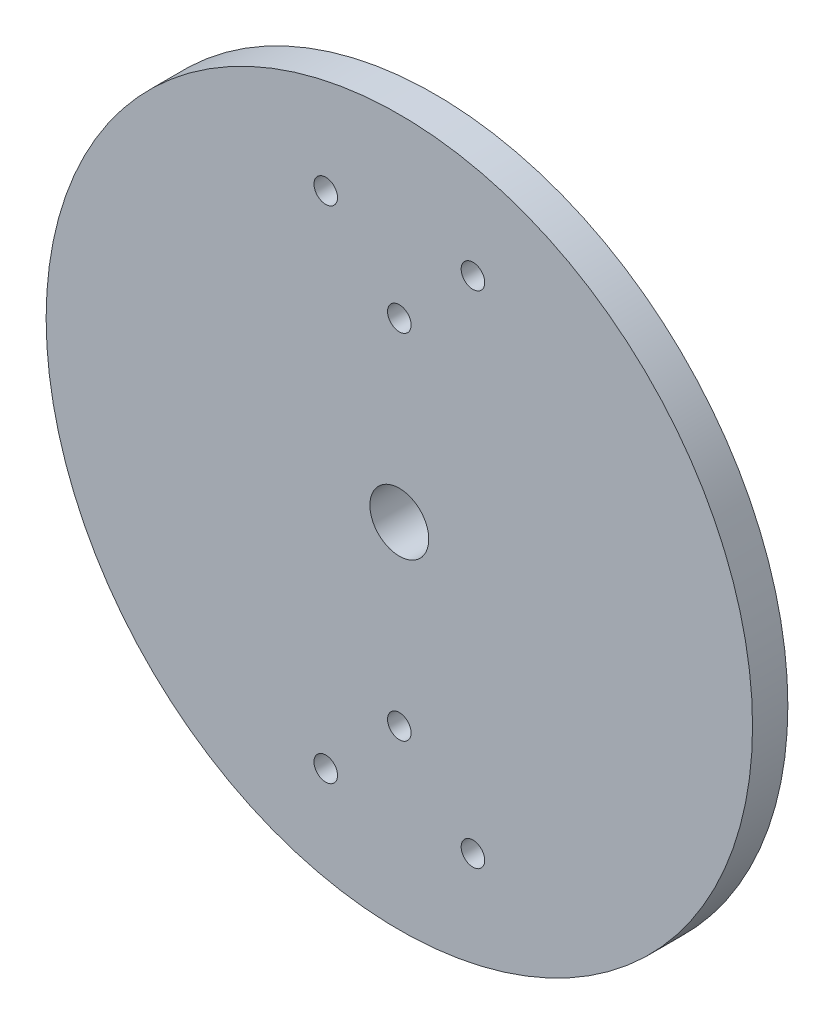
ISO-10303-21;
HEADER;
FILE_DESCRIPTION(('STEP AP214'),'2;1');
FILE_NAME('part.step','',(''),(''),'','','');
FILE_SCHEMA(('AUTOMOTIVE_DESIGN { 1 0 10303 214 1 1 1 1 }'));
ENDSEC;
DATA;
#1=APPLICATION_CONTEXT('core data for automotive mechanical design processes');
#2=APPLICATION_PROTOCOL_DEFINITION('international standard','automotive_design',2000,#1);
#3=PRODUCT_CONTEXT('',#1,'mechanical');
#4=PRODUCT('Part','Part','',(#3));
#5=PRODUCT_RELATED_PRODUCT_CATEGORY('part','',(#4));
#6=PRODUCT_DEFINITION_FORMATION('','',#4);
#7=PRODUCT_DEFINITION_CONTEXT('part definition',#1,'design');
#8=PRODUCT_DEFINITION('design','',#6,#7);
#9=PRODUCT_DEFINITION_SHAPE('','',#8);
#10=(LENGTH_UNIT() NAMED_UNIT(*) SI_UNIT(.MILLI.,.METRE.));
#11=(NAMED_UNIT(*) PLANE_ANGLE_UNIT() SI_UNIT($,.RADIAN.));
#12=(NAMED_UNIT(*) SI_UNIT($,.STERADIAN.) SOLID_ANGLE_UNIT());
#13=UNCERTAINTY_MEASURE_WITH_UNIT(LENGTH_MEASURE(1.E-05),#10,'distance_accuracy_value','');
#14=(GEOMETRIC_REPRESENTATION_CONTEXT(3) GLOBAL_UNCERTAINTY_ASSIGNED_CONTEXT((#13)) GLOBAL_UNIT_ASSIGNED_CONTEXT((#10,
#11,#12)) REPRESENTATION_CONTEXT('',''));
#15=CARTESIAN_POINT('',(0.,0.,0.));
#16=DIRECTION('',(0.,0.,1.));
#17=DIRECTION('',(1.,0.,0.));
#18=AXIS2_PLACEMENT_3D('',#15,#16,#17);
#19=CARTESIAN_POINT('',(0.,0.,7.62));
#20=DIRECTION('',(0.,0.,1.));
#21=DIRECTION('',(1.,0.,0.));
#22=AXIS2_PLACEMENT_3D('',#19,#20,#21);
#23=PLANE('',#22);
#24=CARTESIAN_POINT('',(15.875,-53.9750000000001,7.62));
#25=DIRECTION('',(0.,0.,1.));
#26=DIRECTION('',(1.,0.,0.));
#27=AXIS2_PLACEMENT_3D('',#24,#25,#26);
#28=CIRCLE('',#27,2.54);
#29=CARTESIAN_POINT('',(18.415,-53.9750000000001,7.62));
#30=VERTEX_POINT('',#29);
#31=EDGE_CURVE('E161',#30,#30,#28,.T.);
#32=ORIENTED_EDGE('',*,*,#31,.F.);
#33=EDGE_LOOP('',(#32));
#34=FACE_BOUND('',#33,.T.);
#35=CARTESIAN_POINT('',(0.,38.1000000000001,7.62));
#36=DIRECTION('',(0.,0.,1.));
#37=DIRECTION('',(1.,0.,0.));
#38=AXIS2_PLACEMENT_3D('',#35,#36,#37);
#39=CIRCLE('',#38,2.54);
#40=CARTESIAN_POINT('',(2.54000000000002,38.1000000000001,7.62));
#41=VERTEX_POINT('',#40);
#42=EDGE_CURVE('E156',#41,#41,#39,.F.);
#43=ORIENTED_EDGE('',*,*,#42,.T.);
#44=EDGE_LOOP('',(#43));
#45=FACE_BOUND('',#44,.T.);
#46=CARTESIAN_POINT('',(0.,-1.11022302462516E-13,7.62));
#47=DIRECTION('',(0.,0.,1.));
#48=DIRECTION('',(1.,0.,0.));
#49=AXIS2_PLACEMENT_3D('',#46,#47,#48);
#50=CIRCLE('',#49,6.35000000000002);
#51=CARTESIAN_POINT('',(-6.34999999999997,-1.11022302462516E-13,7.62));
#52=VERTEX_POINT('',#51);
#53=EDGE_CURVE('E79',#52,#52,#50,.T.);
#54=ORIENTED_EDGE('',*,*,#53,.F.);
#55=EDGE_LOOP('',(#54));
#56=FACE_BOUND('',#55,.T.);
#57=CARTESIAN_POINT('',(0.,-1.11022302462516E-13,7.62));
#58=DIRECTION('',(0.,0.,1.));
#59=DIRECTION('',(1.,0.,0.));
#60=AXIS2_PLACEMENT_3D('',#57,#58,#59);
#61=CIRCLE('',#60,76.2);
#62=CARTESIAN_POINT('',(-76.1999999999999,-1.11022302462516E-13,7.62));
#63=VERTEX_POINT('',#62);
#64=EDGE_CURVE('E76',#63,#63,#61,.T.);
#65=ORIENTED_EDGE('',*,*,#64,.T.);
#66=EDGE_LOOP('',(#65));
#67=FACE_BOUND('',#66,.T.);
#68=CARTESIAN_POINT('',(-15.875,-53.9750000000001,7.62));
#69=DIRECTION('',(0.,0.,1.));
#70=DIRECTION('',(1.,0.,0.));
#71=AXIS2_PLACEMENT_3D('',#68,#69,#70);
#72=CIRCLE('',#71,2.54);
#73=CARTESIAN_POINT('',(-13.335,-53.9750000000001,7.62));
#74=VERTEX_POINT('',#73);
#75=EDGE_CURVE('E68',#74,#74,#72,.T.);
#76=ORIENTED_EDGE('',*,*,#75,.F.);
#77=EDGE_LOOP('',(#76));
#78=FACE_BOUND('',#77,.T.);
#79=CARTESIAN_POINT('',(0.,-38.1000000000001,7.62));
#80=DIRECTION('',(0.,0.,1.));
#81=DIRECTION('',(1.,0.,0.));
#82=AXIS2_PLACEMENT_3D('',#79,#80,#81);
#83=CIRCLE('',#82,2.54);
#84=CARTESIAN_POINT('',(2.54000000000002,-38.1000000000001,7.62));
#85=VERTEX_POINT('',#84);
#86=EDGE_CURVE('E164',#85,#85,#83,.T.);
#87=ORIENTED_EDGE('',*,*,#86,.F.);
#88=EDGE_LOOP('',(#87));
#89=FACE_BOUND('',#88,.T.);
#90=CARTESIAN_POINT('',(-15.875,53.9750000000001,7.62));
#91=DIRECTION('',(0.,0.,1.));
#92=DIRECTION('',(1.,0.,0.));
#93=AXIS2_PLACEMENT_3D('',#90,#91,#92);
#94=CIRCLE('',#93,2.54);
#95=CARTESIAN_POINT('',(-13.335,53.9750000000001,7.62));
#96=VERTEX_POINT('',#95);
#97=EDGE_CURVE('E158',#96,#96,#94,.F.);
#98=ORIENTED_EDGE('',*,*,#97,.T.);
#99=EDGE_LOOP('',(#98));
#100=FACE_BOUND('',#99,.T.);
#101=CARTESIAN_POINT('',(15.875,53.9750000000001,7.62));
#102=DIRECTION('',(0.,0.,1.));
#103=DIRECTION('',(1.,0.,0.));
#104=AXIS2_PLACEMENT_3D('',#101,#102,#103);
#105=CIRCLE('',#104,2.54);
#106=CARTESIAN_POINT('',(18.415,53.9750000000001,7.62));
#107=VERTEX_POINT('',#106);
#108=EDGE_CURVE('E157',#107,#107,#105,.F.);
#109=ORIENTED_EDGE('',*,*,#108,.T.);
#110=EDGE_LOOP('',(#109));
#111=FACE_BOUND('',#110,.T.);
#112=ADVANCED_FACE('F38',(#34,#45,#56,#67,#78,#89,#100,#111),#23,.T.);
#113=CARTESIAN_POINT('',(0.,0.,0.));
#114=DIRECTION('',(0.,0.,1.));
#115=DIRECTION('',(1.,0.,0.));
#116=AXIS2_PLACEMENT_3D('',#113,#114,#115);
#117=PLANE('',#116);
#118=CARTESIAN_POINT('',(15.875,-53.9750000000001,0.));
#119=DIRECTION('',(0.,0.,1.));
#120=DIRECTION('',(1.,0.,0.));
#121=AXIS2_PLACEMENT_3D('',#118,#119,#120);
#122=CIRCLE('',#121,2.54);
#123=CARTESIAN_POINT('',(18.415,-53.9750000000001,0.));
#124=VERTEX_POINT('',#123);
#125=EDGE_CURVE('E42',#124,#124,#122,.T.);
#126=ORIENTED_EDGE('',*,*,#125,.T.);
#127=EDGE_LOOP('',(#126));
#128=FACE_BOUND('',#127,.T.);
#129=CARTESIAN_POINT('',(-15.875,-53.9750000000001,0.));
#130=DIRECTION('',(0.,0.,1.));
#131=DIRECTION('',(1.,0.,0.));
#132=AXIS2_PLACEMENT_3D('',#129,#130,#131);
#133=CIRCLE('',#132,2.54);
#134=CARTESIAN_POINT('',(-13.335,-53.9750000000001,0.));
#135=VERTEX_POINT('',#134);
#136=EDGE_CURVE('E65',#135,#135,#133,.T.);
#137=ORIENTED_EDGE('',*,*,#136,.T.);
#138=EDGE_LOOP('',(#137));
#139=FACE_BOUND('',#138,.T.);
#140=CARTESIAN_POINT('',(0.,-1.11022302462516E-13,0.));
#141=DIRECTION('',(0.,0.,1.));
#142=DIRECTION('',(1.,0.,0.));
#143=AXIS2_PLACEMENT_3D('',#140,#141,#142);
#144=CIRCLE('',#143,76.2);
#145=CARTESIAN_POINT('',(-76.1999999999999,-1.11022302462516E-13,0.));
#146=VERTEX_POINT('',#145);
#147=EDGE_CURVE('E75',#146,#146,#144,.T.);
#148=ORIENTED_EDGE('',*,*,#147,.F.);
#149=EDGE_LOOP('',(#148));
#150=FACE_BOUND('',#149,.T.);
#151=CARTESIAN_POINT('',(-15.875,53.9750000000001,0.));
#152=DIRECTION('',(0.,0.,1.));
#153=DIRECTION('',(1.,0.,0.));
#154=AXIS2_PLACEMENT_3D('',#151,#152,#153);
#155=CIRCLE('',#154,2.54);
#156=CARTESIAN_POINT('',(-13.335,53.9750000000001,0.));
#157=VERTEX_POINT('',#156);
#158=EDGE_CURVE('E86',#157,#157,#155,.F.);
#159=ORIENTED_EDGE('',*,*,#158,.F.);
#160=EDGE_LOOP('',(#159));
#161=FACE_BOUND('',#160,.T.);
#162=CARTESIAN_POINT('',(0.,-1.11022302462516E-13,0.));
#163=DIRECTION('',(0.,0.,1.));
#164=DIRECTION('',(1.,0.,0.));
#165=AXIS2_PLACEMENT_3D('',#162,#163,#164);
#166=CIRCLE('',#165,35.56);
#167=CARTESIAN_POINT('',(0.,35.5599999999999,0.));
#168=VERTEX_POINT('',#167);
#169=CARTESIAN_POINT('',(0.,-35.5600000000001,0.));
#170=VERTEX_POINT('',#169);
#171=EDGE_CURVE('E47',#168,#170,#166,.F.);
#172=ORIENTED_EDGE('',*,*,#171,.F.);
#173=CARTESIAN_POINT('',(0.,38.1000000000001,0.));
#174=DIRECTION('',(0.,0.,1.));
#175=DIRECTION('',(1.,0.,0.));
#176=AXIS2_PLACEMENT_3D('',#173,#174,#175);
#177=CIRCLE('',#176,2.54);
#178=EDGE_CURVE('E53',#168,#168,#177,.F.);
#179=ORIENTED_EDGE('',*,*,#178,.F.);
#180=EDGE_CURVE('E11',#170,#168,#166,.F.);
#181=ORIENTED_EDGE('',*,*,#180,.F.);
#182=CARTESIAN_POINT('',(0.,-38.1000000000001,0.));
#183=DIRECTION('',(0.,0.,1.));
#184=DIRECTION('',(1.,0.,0.));
#185=AXIS2_PLACEMENT_3D('',#182,#183,#184);
#186=CIRCLE('',#185,2.54);
#187=EDGE_CURVE('E57',#170,#170,#186,.T.);
#188=ORIENTED_EDGE('',*,*,#187,.T.);
#189=EDGE_LOOP('',(#172,#179,#181,#188));
#190=FACE_BOUND('',#189,.T.);
#191=CARTESIAN_POINT('',(15.875,53.9750000000001,0.));
#192=DIRECTION('',(0.,0.,1.));
#193=DIRECTION('',(1.,0.,0.));
#194=AXIS2_PLACEMENT_3D('',#191,#192,#193);
#195=CIRCLE('',#194,2.54);
#196=CARTESIAN_POINT('',(18.415,53.9750000000001,0.));
#197=VERTEX_POINT('',#196);
#198=EDGE_CURVE('E88',#197,#197,#195,.F.);
#199=ORIENTED_EDGE('',*,*,#198,.F.);
#200=EDGE_LOOP('',(#199));
#201=FACE_BOUND('',#200,.T.);
#202=ADVANCED_FACE('F95',(#128,#139,#150,#161,#190,#201),#117,.F.);
#203=CARTESIAN_POINT('',(0.,-1.11022302462516E-13,-5.08));
#204=DIRECTION('',(0.,0.,-1.));
#205=DIRECTION('',(-1.,0.,0.));
#206=AXIS2_PLACEMENT_3D('',#203,#204,#205);
#207=PLANE('',#206);
#208=CARTESIAN_POINT('',(0.,-1.11022302462516E-13,-5.08));
#209=DIRECTION('',(0.,0.,-1.));
#210=DIRECTION('',(-1.,0.,0.));
#211=AXIS2_PLACEMENT_3D('',#208,#209,#210);
#212=CIRCLE('',#211,35.56);
#213=CARTESIAN_POINT('',(-35.5599999999999,-1.11022302462516E-13,-5.08));
#214=VERTEX_POINT('',#213);
#215=EDGE_CURVE('E72',#214,#214,#212,.T.);
#216=ORIENTED_EDGE('',*,*,#215,.T.);
#217=EDGE_LOOP('',(#216));
#218=FACE_BOUND('',#217,.T.);
#219=CARTESIAN_POINT('',(0.,-1.11022302462516E-13,-5.08));
#220=DIRECTION('',(0.,0.,-1.));
#221=DIRECTION('',(-1.,0.,0.));
#222=AXIS2_PLACEMENT_3D('',#219,#220,#221);
#223=CIRCLE('',#222,6.35000000000002);
#224=CARTESIAN_POINT('',(-6.34999999999997,-1.11022302462516E-13,-5.08));
#225=VERTEX_POINT('',#224);
#226=EDGE_CURVE('E63',#225,#225,#223,.F.);
#227=ORIENTED_EDGE('',*,*,#226,.T.);
#228=EDGE_LOOP('',(#227));
#229=FACE_BOUND('',#228,.T.);
#230=ADVANCED_FACE('F117',(#218,#229),#207,.T.);
#231=CARTESIAN_POINT('',(0.,-1.11022302462516E-13,7.62));
#232=DIRECTION('',(0.,0.,-1.));
#233=DIRECTION('',(-1.,0.,0.));
#234=AXIS2_PLACEMENT_3D('',#231,#232,#233);
#235=CYLINDRICAL_SURFACE('',#234,76.2);
#236=CARTESIAN_POINT('',(-76.1999999999999,-1.11022302462516E-13,7.62));
#237=CARTESIAN_POINT('',(-76.1999999999999,-1.11022302462516E-13,7.540625));
#238=CARTESIAN_POINT('',(-76.1999999999999,-1.11022302462516E-13,7.46125));
#239=CARTESIAN_POINT('',(-76.1999999999999,-1.11022302462516E-13,7.3025));
#240=CARTESIAN_POINT('',(-76.1999999999999,-1.11022302462516E-13,7.223125));
#241=CARTESIAN_POINT('',(-76.1999999999999,-1.11022302462516E-13,7.064375));
#242=CARTESIAN_POINT('',(-76.1999999999999,-1.11022302462516E-13,6.985));
#243=CARTESIAN_POINT('',(-76.1999999999999,-1.11022302462516E-13,6.82625));
#244=CARTESIAN_POINT('',(-76.1999999999999,-1.11022302462516E-13,6.746875));
#245=CARTESIAN_POINT('',(-76.1999999999999,-1.11022302462516E-13,6.588125));
#246=CARTESIAN_POINT('',(-76.1999999999999,-1.11022302462516E-13,6.50875));
#247=CARTESIAN_POINT('',(-76.1999999999999,-1.11022302462516E-13,6.35));
#248=CARTESIAN_POINT('',(-76.1999999999999,-1.11022302462516E-13,6.270625));
#249=CARTESIAN_POINT('',(-76.1999999999999,-1.11022302462516E-13,6.111875));
#250=CARTESIAN_POINT('',(-76.1999999999999,-1.11022302462516E-13,6.0325));
#251=CARTESIAN_POINT('',(-76.1999999999999,-1.11022302462516E-13,5.87375));
#252=CARTESIAN_POINT('',(-76.1999999999999,-1.11022302462516E-13,5.794375));
#253=CARTESIAN_POINT('',(-76.1999999999999,-1.11022302462516E-13,5.635625));
#254=CARTESIAN_POINT('',(-76.1999999999999,-1.11022302462516E-13,5.55625));
#255=CARTESIAN_POINT('',(-76.1999999999999,-1.11022302462516E-13,5.3975));
#256=CARTESIAN_POINT('',(-76.1999999999999,-1.11022302462516E-13,5.318125));
#257=CARTESIAN_POINT('',(-76.1999999999999,-1.11022302462516E-13,5.159375));
#258=CARTESIAN_POINT('',(-76.1999999999999,-1.11022302462516E-13,5.08));
#259=CARTESIAN_POINT('',(-76.1999999999999,-1.11022302462516E-13,4.92125));
#260=CARTESIAN_POINT('',(-76.1999999999999,-1.11022302462516E-13,4.841875));
#261=CARTESIAN_POINT('',(-76.1999999999999,-1.11022302462516E-13,4.683125));
#262=CARTESIAN_POINT('',(-76.1999999999999,-1.11022302462516E-13,4.60375));
#263=CARTESIAN_POINT('',(-76.1999999999999,-1.11022302462516E-13,4.445));
#264=CARTESIAN_POINT('',(-76.1999999999999,-1.11022302462516E-13,4.365625));
#265=CARTESIAN_POINT('',(-76.1999999999999,-1.11022302462516E-13,4.206875));
#266=CARTESIAN_POINT('',(-76.1999999999999,-1.11022302462516E-13,4.1275));
#267=CARTESIAN_POINT('',(-76.1999999999999,-1.11022302462516E-13,3.96875));
#268=CARTESIAN_POINT('',(-76.1999999999999,-1.11022302462516E-13,3.889375));
#269=CARTESIAN_POINT('',(-76.1999999999999,-1.11022302462516E-13,3.730625));
#270=CARTESIAN_POINT('',(-76.1999999999999,-1.11022302462516E-13,3.65125));
#271=CARTESIAN_POINT('',(-76.1999999999999,-1.11022302462516E-13,3.4925));
#272=CARTESIAN_POINT('',(-76.1999999999999,-1.11022302462516E-13,3.413125));
#273=CARTESIAN_POINT('',(-76.1999999999999,-1.11022302462516E-13,3.254375));
#274=CARTESIAN_POINT('',(-76.1999999999999,-1.11022302462516E-13,3.175));
#275=CARTESIAN_POINT('',(-76.1999999999999,-1.11022302462516E-13,3.01625));
#276=CARTESIAN_POINT('',(-76.1999999999999,-1.11022302462516E-13,2.936875));
#277=CARTESIAN_POINT('',(-76.1999999999999,-1.11022302462516E-13,2.778125));
#278=CARTESIAN_POINT('',(-76.1999999999999,-1.11022302462516E-13,2.69875));
#279=CARTESIAN_POINT('',(-76.1999999999999,-1.11022302462516E-13,2.54));
#280=CARTESIAN_POINT('',(-76.1999999999999,-1.11022302462516E-13,2.460625));
#281=CARTESIAN_POINT('',(-76.1999999999999,-1.11022302462516E-13,2.301875));
#282=CARTESIAN_POINT('',(-76.1999999999999,-1.11022302462516E-13,2.2225));
#283=CARTESIAN_POINT('',(-76.1999999999999,-1.11022302462516E-13,2.06375));
#284=CARTESIAN_POINT('',(-76.1999999999999,-1.11022302462516E-13,1.984375));
#285=CARTESIAN_POINT('',(-76.1999999999999,-1.11022302462516E-13,1.825625));
#286=CARTESIAN_POINT('',(-76.1999999999999,-1.11022302462516E-13,1.74625));
#287=CARTESIAN_POINT('',(-76.1999999999999,-1.11022302462516E-13,1.5875));
#288=CARTESIAN_POINT('',(-76.1999999999999,-1.11022302462516E-13,1.508125));
#289=CARTESIAN_POINT('',(-76.1999999999999,-1.11022302462516E-13,1.349375));
#290=CARTESIAN_POINT('',(-76.1999999999999,-1.11022302462516E-13,1.27));
#291=CARTESIAN_POINT('',(-76.1999999999999,-1.11022302462516E-13,1.11125));
#292=CARTESIAN_POINT('',(-76.1999999999999,-1.11022302462516E-13,1.031875));
#293=CARTESIAN_POINT('',(-76.1999999999999,-1.11022302462516E-13,0.873125));
#294=CARTESIAN_POINT('',(-76.1999999999999,-1.11022302462516E-13,0.79375));
#295=CARTESIAN_POINT('',(-76.1999999999999,-1.11022302462516E-13,0.635));
#296=CARTESIAN_POINT('',(-76.1999999999999,-1.11022302462516E-13,0.555625));
#297=CARTESIAN_POINT('',(-76.1999999999999,-1.11022302462516E-13,0.396875));
#298=CARTESIAN_POINT('',(-76.1999999999999,-1.11022302462516E-13,0.3175));
#299=CARTESIAN_POINT('',(-76.1999999999999,-1.11022302462516E-13,0.15875));
#300=CARTESIAN_POINT('',(-76.1999999999999,-1.11022302462516E-13,0.0793749999999999));
#301=CARTESIAN_POINT('',(-76.1999999999999,-1.11022302462516E-13,0.));
#302=B_SPLINE_CURVE_WITH_KNOTS('',3,(#236,#237,#238,#239,#240,#241,#242,#243,#244,#245,#246,
#247,#248,#249,#250,#251,#252,#253,#254,#255,#256,#257,#258,#259,#260,#261,#262,#263,#264,#265,
#266,#267,#268,#269,#270,#271,#272,#273,#274,#275,#276,#277,#278,#279,#280,#281,#282,#283,#284,
#285,#286,#287,#288,#289,#290,#291,#292,#293,#294,#295,#296,#297,#298,#299,#300,#301),
.UNSPECIFIED.,.F.,.F.,(4,2,2,2,2,2,2,2,2,2,2,2,2,2,2,2,2,2,2,2,2,2,2,2,2,2,2,2,2,2,2,2,4),(0.,
0.238125,0.476249999999999,0.714375,0.952499999999999,1.190625,1.42875,1.666875,1.905,2.143125,
2.38125,2.619375,2.8575,3.095625,3.33375,3.571875,3.81,4.048125,4.28625,4.524375,4.7625,
5.000625,5.23875,5.476875,5.715,5.953125,6.19125,6.429375,6.6675,6.905625,7.14375,7.381875,
7.62),.UNSPECIFIED.);
#303=EDGE_CURVE('BSEAM40',#63,#146,#302,.T.);
#304=ORIENTED_EDGE('',*,*,#64,.F.);
#305=ORIENTED_EDGE('',*,*,#147,.T.);
#306=ORIENTED_EDGE('',*,*,#303,.T.);
#307=ORIENTED_EDGE('',*,*,#303,.F.);
#308=EDGE_LOOP('',(#304,#306,#305,#307));
#309=FACE_BOUND('',#308,.T.);
#310=ADVANCED_FACE('F40',(#309),#235,.T.);
#311=CARTESIAN_POINT('',(0.,-1.11022302462516E-13,7.62));
#312=DIRECTION('',(0.,0.,-1.));
#313=DIRECTION('',(-1.,0.,0.));
#314=AXIS2_PLACEMENT_3D('',#311,#312,#313);
#315=CYLINDRICAL_SURFACE('',#314,6.35000000000002);
#316=CARTESIAN_POINT('',(-6.34999999999997,-1.11022302462516E-13,7.62));
#317=CARTESIAN_POINT('',(-6.34999999999997,-1.11022302462516E-13,7.48770833333333));
#318=CARTESIAN_POINT('',(-6.34999999999997,-1.11022302462516E-13,7.35541666666667));
#319=CARTESIAN_POINT('',(-6.34999999999997,-1.11022302462516E-13,7.09083333333333));
#320=CARTESIAN_POINT('',(-6.34999999999997,-1.11022302462516E-13,6.95854166666667));
#321=CARTESIAN_POINT('',(-6.34999999999997,-1.11022302462516E-13,6.69395833333333));
#322=CARTESIAN_POINT('',(-6.34999999999997,-1.11022302462516E-13,6.56166666666667));
#323=CARTESIAN_POINT('',(-6.34999999999997,-1.11022302462516E-13,6.29708333333333));
#324=CARTESIAN_POINT('',(-6.34999999999997,-1.11022302462516E-13,6.16479166666667));
#325=CARTESIAN_POINT('',(-6.34999999999997,-1.11022302462516E-13,5.90020833333333));
#326=CARTESIAN_POINT('',(-6.34999999999997,-1.11022302462516E-13,5.76791666666667));
#327=CARTESIAN_POINT('',(-6.34999999999997,-1.11022302462516E-13,5.50333333333333));
#328=CARTESIAN_POINT('',(-6.34999999999997,-1.11022302462516E-13,5.37104166666667));
#329=CARTESIAN_POINT('',(-6.34999999999997,-1.11022302462516E-13,5.10645833333333));
#330=CARTESIAN_POINT('',(-6.34999999999997,-1.11022302462516E-13,4.97416666666667));
#331=CARTESIAN_POINT('',(-6.34999999999997,-1.11022302462516E-13,4.70958333333333));
#332=CARTESIAN_POINT('',(-6.34999999999997,-1.11022302462516E-13,4.57729166666667));
#333=CARTESIAN_POINT('',(-6.34999999999997,-1.11022302462516E-13,4.31270833333333));
#334=CARTESIAN_POINT('',(-6.34999999999997,-1.11022302462516E-13,4.18041666666667));
#335=CARTESIAN_POINT('',(-6.34999999999997,-1.11022302462516E-13,3.91583333333333));
#336=CARTESIAN_POINT('',(-6.34999999999997,-1.11022302462516E-13,3.78354166666666));
#337=CARTESIAN_POINT('',(-6.34999999999997,-1.11022302462516E-13,3.51895833333333));
#338=CARTESIAN_POINT('',(-6.34999999999997,-1.11022302462516E-13,3.38666666666666));
#339=CARTESIAN_POINT('',(-6.34999999999997,-1.11022302462516E-13,3.12208333333333));
#340=CARTESIAN_POINT('',(-6.34999999999997,-1.11022302462516E-13,2.98979166666666));
#341=CARTESIAN_POINT('',(-6.34999999999997,-1.11022302462516E-13,2.72520833333333));
#342=CARTESIAN_POINT('',(-6.34999999999997,-1.11022302462516E-13,2.59291666666666));
#343=CARTESIAN_POINT('',(-6.34999999999997,-1.11022302462516E-13,2.32833333333333));
#344=CARTESIAN_POINT('',(-6.34999999999997,-1.11022302462516E-13,2.19604166666666));
#345=CARTESIAN_POINT('',(-6.34999999999997,-1.11022302462516E-13,1.93145833333333));
#346=CARTESIAN_POINT('',(-6.34999999999997,-1.11022302462516E-13,1.79916666666666));
#347=CARTESIAN_POINT('',(-6.34999999999997,-1.11022302462516E-13,1.53458333333333));
#348=CARTESIAN_POINT('',(-6.34999999999997,-1.11022302462516E-13,1.40229166666666));
#349=CARTESIAN_POINT('',(-6.34999999999997,-1.11022302462516E-13,1.13770833333333));
#350=CARTESIAN_POINT('',(-6.34999999999997,-1.11022302462516E-13,1.00541666666666));
#351=CARTESIAN_POINT('',(-6.34999999999997,-1.11022302462516E-13,0.740833333333331));
#352=CARTESIAN_POINT('',(-6.34999999999997,-1.11022302462516E-13,0.608541666666664));
#353=CARTESIAN_POINT('',(-6.34999999999997,-1.11022302462516E-13,0.343958333333331));
#354=CARTESIAN_POINT('',(-6.34999999999997,-1.11022302462516E-13,0.211666666666664));
#355=CARTESIAN_POINT('',(-6.34999999999997,-1.11022302462516E-13,-0.052916666666669));
#356=CARTESIAN_POINT('',(-6.34999999999997,-1.11022302462516E-13,-0.185208333333335));
#357=CARTESIAN_POINT('',(-6.34999999999997,-1.11022302462516E-13,-0.449791666666667));
#358=CARTESIAN_POINT('',(-6.34999999999997,-1.11022302462516E-13,-0.582083333333334));
#359=CARTESIAN_POINT('',(-6.34999999999997,-1.11022302462516E-13,-0.846666666666668));
#360=CARTESIAN_POINT('',(-6.34999999999997,-1.11022302462516E-13,-0.978958333333335));
#361=CARTESIAN_POINT('',(-6.34999999999997,-1.11022302462516E-13,-1.24354166666667));
#362=CARTESIAN_POINT('',(-6.34999999999997,-1.11022302462516E-13,-1.37583333333334));
#363=CARTESIAN_POINT('',(-6.34999999999997,-1.11022302462516E-13,-1.64041666666667));
#364=CARTESIAN_POINT('',(-6.34999999999997,-1.11022302462516E-13,-1.77270833333333));
#365=CARTESIAN_POINT('',(-6.34999999999997,-1.11022302462516E-13,-2.03729166666667));
#366=CARTESIAN_POINT('',(-6.34999999999997,-1.11022302462516E-13,-2.16958333333333));
#367=CARTESIAN_POINT('',(-6.34999999999997,-1.11022302462516E-13,-2.43416666666667));
#368=CARTESIAN_POINT('',(-6.34999999999997,-1.11022302462516E-13,-2.56645833333333));
#369=CARTESIAN_POINT('',(-6.34999999999997,-1.11022302462516E-13,-2.83104166666667));
#370=CARTESIAN_POINT('',(-6.34999999999997,-1.11022302462516E-13,-2.96333333333333));
#371=CARTESIAN_POINT('',(-6.34999999999997,-1.11022302462516E-13,-3.22791666666667));
#372=CARTESIAN_POINT('',(-6.34999999999997,-1.11022302462516E-13,-3.36020833333334));
#373=CARTESIAN_POINT('',(-6.34999999999997,-1.11022302462516E-13,-3.62479166666667));
#374=CARTESIAN_POINT('',(-6.34999999999997,-1.11022302462516E-13,-3.75708333333333));
#375=CARTESIAN_POINT('',(-6.34999999999997,-1.11022302462516E-13,-4.02166666666667));
#376=CARTESIAN_POINT('',(-6.34999999999997,-1.11022302462516E-13,-4.15395833333334));
#377=CARTESIAN_POINT('',(-6.34999999999997,-1.11022302462516E-13,-4.41854166666667));
#378=CARTESIAN_POINT('',(-6.34999999999997,-1.11022302462516E-13,-4.55083333333334));
#379=CARTESIAN_POINT('',(-6.34999999999997,-1.11022302462516E-13,-4.81541666666667));
#380=CARTESIAN_POINT('',(-6.34999999999997,-1.11022302462516E-13,-4.94770833333334));
#381=CARTESIAN_POINT('',(-6.34999999999997,-1.11022302462516E-13,-5.08));
#382=B_SPLINE_CURVE_WITH_KNOTS('',3,(#316,#317,#318,#319,#320,#321,#322,#323,#324,#325,#326,
#327,#328,#329,#330,#331,#332,#333,#334,#335,#336,#337,#338,#339,#340,#341,#342,#343,#344,#345,
#346,#347,#348,#349,#350,#351,#352,#353,#354,#355,#356,#357,#358,#359,#360,#361,#362,#363,#364,
#365,#366,#367,#368,#369,#370,#371,#372,#373,#374,#375,#376,#377,#378,#379,#380,#381),
.UNSPECIFIED.,.F.,.F.,(4,2,2,2,2,2,2,2,2,2,2,2,2,2,2,2,2,2,2,2,2,2,2,2,2,2,2,2,2,2,2,2,4),(0.,
0.396875,0.793749999999999,1.190625,1.5875,1.984375,2.38125,2.778125,3.175,3.571875,3.96875,
4.365625,4.7625,5.159375,5.55625,5.953125,6.35,6.746875,7.14375,7.540625,7.9375,8.334375,
8.73125,9.128125,9.525,9.921875,10.31875,10.715625,11.1125,11.509375,11.90625,12.303125,12.7),.UNSPECIFIED.);
#383=EDGE_CURVE('BSEAM124',#52,#225,#382,.T.);
#384=ORIENTED_EDGE('',*,*,#53,.T.);
#385=ORIENTED_EDGE('',*,*,#226,.F.);
#386=ORIENTED_EDGE('',*,*,#383,.T.);
#387=ORIENTED_EDGE('',*,*,#383,.F.);
#388=EDGE_LOOP('',(#384,#386,#385,#387));
#389=FACE_BOUND('',#388,.T.);
#390=ADVANCED_FACE('F124',(#389),#315,.F.);
#391=CARTESIAN_POINT('',(0.,-1.11022302462516E-13,-5.08));
#392=DIRECTION('',(0.,0.,1.));
#393=DIRECTION('',(1.,0.,0.));
#394=AXIS2_PLACEMENT_3D('',#391,#392,#393);
#395=CYLINDRICAL_SURFACE('',#394,35.56);
#396=ORIENTED_EDGE('',*,*,#180,.T.);
#397=ORIENTED_EDGE('',*,*,#171,.T.);
#398=EDGE_LOOP('',(#396,#397));
#399=FACE_BOUND('',#398,.T.);
#400=ORIENTED_EDGE('',*,*,#215,.F.);
#401=EDGE_LOOP('',(#400));
#402=FACE_BOUND('',#401,.T.);
#403=ADVANCED_FACE('F122',(#399,#402),#395,.T.);
#404=CARTESIAN_POINT('',(-15.875,-53.9750000000001,-17.78));
#405=DIRECTION('',(0.,0.,1.));
#406=DIRECTION('',(1.,0.,0.));
#407=AXIS2_PLACEMENT_3D('',#404,#405,#406);
#408=CYLINDRICAL_SURFACE('',#407,2.54);
#409=ORIENTED_EDGE('',*,*,#75,.T.);
#410=EDGE_LOOP('',(#409));
#411=FACE_BOUND('',#410,.T.);
#412=ORIENTED_EDGE('',*,*,#136,.F.);
#413=EDGE_LOOP('',(#412));
#414=FACE_BOUND('',#413,.T.);
#415=ADVANCED_FACE('F131',(#411,#414),#408,.F.);
#416=CARTESIAN_POINT('',(0.,-38.1000000000001,-17.78));
#417=DIRECTION('',(0.,0.,1.));
#418=DIRECTION('',(1.,0.,0.));
#419=AXIS2_PLACEMENT_3D('',#416,#417,#418);
#420=CYLINDRICAL_SURFACE('',#419,2.54);
#421=ORIENTED_EDGE('',*,*,#86,.T.);
#422=EDGE_LOOP('',(#421));
#423=FACE_BOUND('',#422,.T.);
#424=ORIENTED_EDGE('',*,*,#187,.F.);
#425=EDGE_LOOP('',(#424));
#426=FACE_BOUND('',#425,.T.);
#427=ADVANCED_FACE('F58',(#423,#426),#420,.F.);
#428=CARTESIAN_POINT('',(-15.875,53.9750000000001,-17.78));
#429=DIRECTION('',(0.,0.,1.));
#430=DIRECTION('',(1.,0.,0.));
#431=AXIS2_PLACEMENT_3D('',#428,#429,#430);
#432=CYLINDRICAL_SURFACE('',#431,2.54);
#433=ORIENTED_EDGE('',*,*,#97,.F.);
#434=EDGE_LOOP('',(#433));
#435=FACE_BOUND('',#434,.T.);
#436=ORIENTED_EDGE('',*,*,#158,.T.);
#437=EDGE_LOOP('',(#436));
#438=FACE_BOUND('',#437,.T.);
#439=ADVANCED_FACE('F146',(#435,#438),#432,.F.);
#440=CARTESIAN_POINT('',(0.,38.1000000000001,-17.78));
#441=DIRECTION('',(0.,0.,1.));
#442=DIRECTION('',(1.,0.,0.));
#443=AXIS2_PLACEMENT_3D('',#440,#441,#442);
#444=CYLINDRICAL_SURFACE('',#443,2.54);
#445=ORIENTED_EDGE('',*,*,#42,.F.);
#446=EDGE_LOOP('',(#445));
#447=FACE_BOUND('',#446,.T.);
#448=ORIENTED_EDGE('',*,*,#178,.T.);
#449=EDGE_LOOP('',(#448));
#450=FACE_BOUND('',#449,.T.);
#451=ADVANCED_FACE('F106',(#447,#450),#444,.F.);
#452=CARTESIAN_POINT('',(15.875,53.9750000000001,-17.78));
#453=DIRECTION('',(0.,0.,1.));
#454=DIRECTION('',(1.,0.,0.));
#455=AXIS2_PLACEMENT_3D('',#452,#453,#454);
#456=CYLINDRICAL_SURFACE('',#455,2.54);
#457=ORIENTED_EDGE('',*,*,#108,.F.);
#458=EDGE_LOOP('',(#457));
#459=FACE_BOUND('',#458,.T.);
#460=ORIENTED_EDGE('',*,*,#198,.T.);
#461=EDGE_LOOP('',(#460));
#462=FACE_BOUND('',#461,.T.);
#463=ADVANCED_FACE('F100',(#459,#462),#456,.F.);
#464=CARTESIAN_POINT('',(15.875,-53.9750000000001,-17.78));
#465=DIRECTION('',(0.,0.,1.));
#466=DIRECTION('',(1.,0.,0.));
#467=AXIS2_PLACEMENT_3D('',#464,#465,#466);
#468=CYLINDRICAL_SURFACE('',#467,2.54);
#469=ORIENTED_EDGE('',*,*,#31,.T.);
#470=EDGE_LOOP('',(#469));
#471=FACE_BOUND('',#470,.T.);
#472=ORIENTED_EDGE('',*,*,#125,.F.);
#473=EDGE_LOOP('',(#472));
#474=FACE_BOUND('',#473,.T.);
#475=ADVANCED_FACE('F98',(#471,#474),#468,.F.);
#476=CLOSED_SHELL('',(#112,#202,#230,#310,#390,#403,#415,#427,#439,#451,#463,#475));
#477=MANIFOLD_SOLID_BREP('B2',#476);
#478=ADVANCED_BREP_SHAPE_REPRESENTATION('',(#18,#477),#14);
#479=SHAPE_DEFINITION_REPRESENTATION(#9,#478);
ENDSEC;
END-ISO-10303-21;
